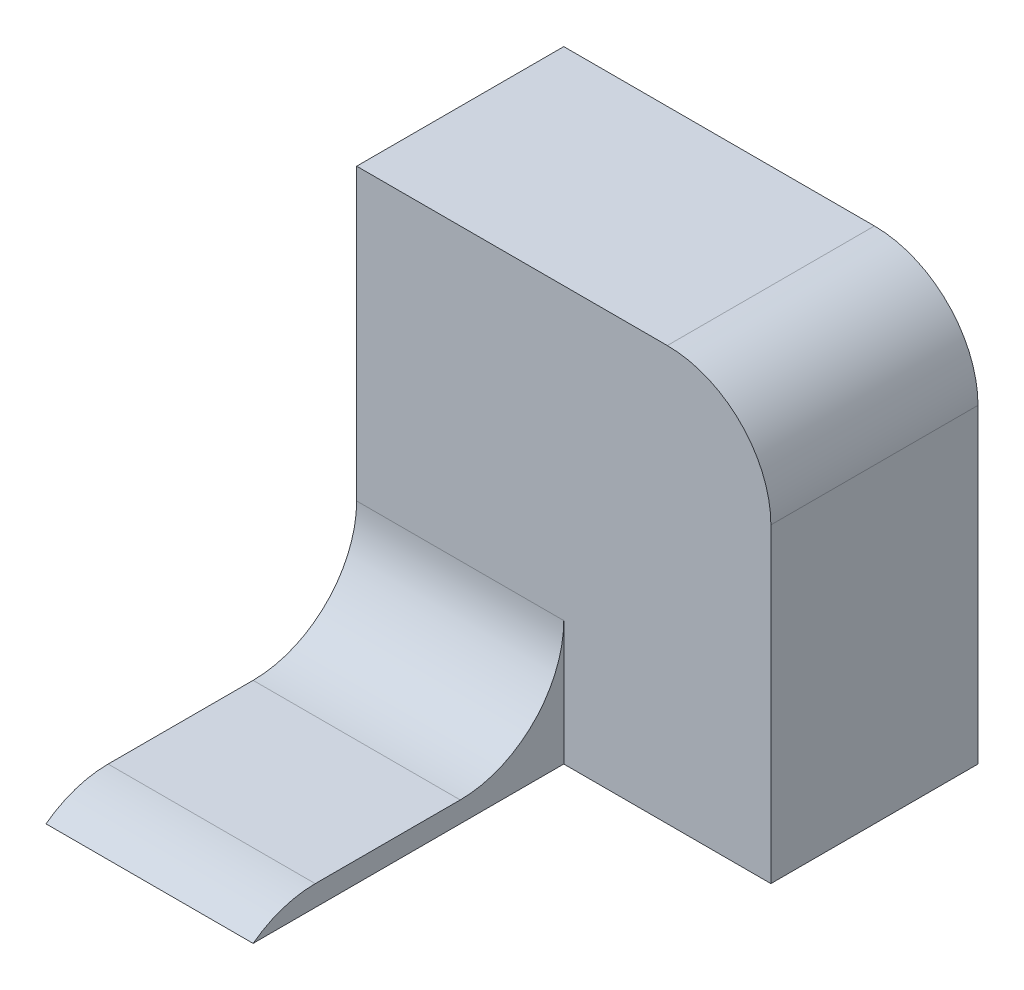
ISO-10303-21;
HEADER;
FILE_DESCRIPTION(('STEP AP214'),'2;1');
FILE_NAME('part.step','',(''),(''),'','','');
FILE_SCHEMA(('AUTOMOTIVE_DESIGN { 1 0 10303 214 1 1 1 1 }'));
ENDSEC;
DATA;
#1=APPLICATION_CONTEXT('core data for automotive mechanical design processes');
#2=APPLICATION_PROTOCOL_DEFINITION('international standard','automotive_design',2000,#1);
#3=PRODUCT_CONTEXT('',#1,'mechanical');
#4=PRODUCT('Part','Part','',(#3));
#5=PRODUCT_RELATED_PRODUCT_CATEGORY('part','',(#4));
#6=PRODUCT_DEFINITION_FORMATION('','',#4);
#7=PRODUCT_DEFINITION_CONTEXT('part definition',#1,'design');
#8=PRODUCT_DEFINITION('design','',#6,#7);
#9=PRODUCT_DEFINITION_SHAPE('','',#8);
#10=(LENGTH_UNIT() NAMED_UNIT(*) SI_UNIT(.MILLI.,.METRE.));
#11=(NAMED_UNIT(*) PLANE_ANGLE_UNIT() SI_UNIT($,.RADIAN.));
#12=(NAMED_UNIT(*) SI_UNIT($,.STERADIAN.) SOLID_ANGLE_UNIT());
#13=UNCERTAINTY_MEASURE_WITH_UNIT(LENGTH_MEASURE(1.E-05),#10,'distance_accuracy_value','');
#14=(GEOMETRIC_REPRESENTATION_CONTEXT(3) GLOBAL_UNCERTAINTY_ASSIGNED_CONTEXT((#13)) GLOBAL_UNIT_ASSIGNED_CONTEXT((#10,
#11,#12)) REPRESENTATION_CONTEXT('',''));
#15=CARTESIAN_POINT('',(0.,0.,0.));
#16=DIRECTION('',(0.,0.,1.));
#17=DIRECTION('',(1.,0.,0.));
#18=AXIS2_PLACEMENT_3D('',#15,#16,#17);
#19=CARTESIAN_POINT('',(-10.,0.,30.));
#20=DIRECTION('',(0.,-1.,0.));
#21=DIRECTION('',(1.,0.,0.));
#22=AXIS2_PLACEMENT_3D('',#19,#20,#21);
#23=PLANE('',#22);
#24=DIRECTION('',(0.,0.,-1.));
#25=VECTOR('',#24,1.);
#26=CARTESIAN_POINT('',(-10.,0.,30.));
#27=LINE('',#26,#25);
#28=CARTESIAN_POINT('',(-10.,0.,24.));
#29=VERTEX_POINT('',#28);
#30=CARTESIAN_POINT('',(-10.,0.,10.));
#31=VERTEX_POINT('',#30);
#32=EDGE_CURVE('E144',#29,#31,#27,.T.);
#33=ORIENTED_EDGE('',*,*,#32,.T.);
#34=DIRECTION('',(-1.,0.,0.));
#35=VECTOR('',#34,1.);
#36=CARTESIAN_POINT('',(-10.,0.,10.));
#37=LINE('',#36,#35);
#38=CARTESIAN_POINT('',(-30.,0.,10.));
#39=VERTEX_POINT('',#38);
#40=EDGE_CURVE('E158',#31,#39,#37,.T.);
#41=ORIENTED_EDGE('',*,*,#40,.T.);
#42=DIRECTION('',(0.,0.,-1.));
#43=VECTOR('',#42,1.);
#44=CARTESIAN_POINT('',(-30.,0.,30.));
#45=LINE('',#44,#43);
#46=CARTESIAN_POINT('',(-30.,0.,24.));
#47=VERTEX_POINT('',#46);
#48=EDGE_CURVE('E153',#47,#39,#45,.T.);
#49=ORIENTED_EDGE('',*,*,#48,.F.);
#50=DIRECTION('',(-1.,0.,0.));
#51=VECTOR('',#50,1.);
#52=CARTESIAN_POINT('',(-10.,0.,24.));
#53=LINE('',#52,#51);
#54=EDGE_CURVE('E156',#47,#29,#53,.F.);
#55=ORIENTED_EDGE('',*,*,#54,.T.);
#56=EDGE_LOOP('',(#33,#41,#49,#55));
#57=FACE_BOUND('',#56,.T.);
#58=ADVANCED_FACE('F35',(#57),#23,.F.);
#59=CARTESIAN_POINT('',(-30.,0.,30.));
#60=DIRECTION('',(1.,0.,0.));
#61=DIRECTION('',(0.,0.,-1.));
#62=AXIS2_PLACEMENT_3D('',#59,#60,#61);
#63=PLANE('',#62);
#64=DIRECTION('',(0.,0.,-1.));
#65=VECTOR('',#64,1.);
#66=CARTESIAN_POINT('',(-30.,-2.,30.));
#67=LINE('',#66,#65);
#68=CARTESIAN_POINT('',(-30.,-2.,30.));
#69=VERTEX_POINT('',#68);
#70=CARTESIAN_POINT('',(-30.,-2.,-20.));
#71=VERTEX_POINT('',#70);
#72=EDGE_CURVE('E151',#69,#71,#67,.T.);
#73=ORIENTED_EDGE('',*,*,#72,.F.);
#74=CARTESIAN_POINT('',(-30.,-10.,24.));
#75=DIRECTION('',(1.,0.,0.));
#76=DIRECTION('',(0.,0.,-1.));
#77=AXIS2_PLACEMENT_3D('',#74,#75,#76);
#78=CIRCLE('',#77,10.);
#79=EDGE_CURVE('E171',#69,#47,#78,.F.);
#80=ORIENTED_EDGE('',*,*,#79,.T.);
#81=ORIENTED_EDGE('',*,*,#48,.T.);
#82=CARTESIAN_POINT('',(-30.,10.,10.));
#83=DIRECTION('',(1.,0.,0.));
#84=DIRECTION('',(0.,0.,-1.));
#85=AXIS2_PLACEMENT_3D('',#82,#83,#84);
#86=CIRCLE('',#85,10.);
#87=CARTESIAN_POINT('',(-30.,10.,0.));
#88=VERTEX_POINT('',#87);
#89=EDGE_CURVE('E43',#39,#88,#86,.T.);
#90=ORIENTED_EDGE('',*,*,#89,.T.);
#91=DIRECTION('',(0.,-1.,0.));
#92=VECTOR('',#91,1.);
#93=CARTESIAN_POINT('',(-30.,38.,0.));
#94=LINE('',#93,#92);
#95=CARTESIAN_POINT('',(-30.,38.,0.));
#96=VERTEX_POINT('',#95);
#97=EDGE_CURVE('E119',#96,#88,#94,.T.);
#98=ORIENTED_EDGE('',*,*,#97,.F.);
#99=DIRECTION('',(0.,0.,1.));
#100=VECTOR('',#99,1.);
#101=CARTESIAN_POINT('',(-30.,38.,-20.));
#102=LINE('',#101,#100);
#103=CARTESIAN_POINT('',(-30.,38.,-20.));
#104=VERTEX_POINT('',#103);
#105=EDGE_CURVE('E108',#104,#96,#102,.T.);
#106=ORIENTED_EDGE('',*,*,#105,.F.);
#107=DIRECTION('',(0.,-1.,0.));
#108=VECTOR('',#107,1.);
#109=CARTESIAN_POINT('',(-30.,38.,-20.));
#110=LINE('',#109,#108);
#111=EDGE_CURVE('E111',#104,#71,#110,.T.);
#112=ORIENTED_EDGE('',*,*,#111,.T.);
#113=EDGE_LOOP('',(#73,#80,#81,#90,#98,#106,#112));
#114=FACE_BOUND('',#113,.T.);
#115=ADVANCED_FACE('F117',(#114),#63,.F.);
#116=CARTESIAN_POINT('',(-30.,-2.,30.));
#117=DIRECTION('',(0.,1.,0.));
#118=DIRECTION('',(0.,0.,1.));
#119=AXIS2_PLACEMENT_3D('',#116,#117,#118);
#120=PLANE('',#119);
#121=ORIENTED_EDGE('',*,*,#72,.T.);
#122=DIRECTION('',(1.,0.,0.));
#123=VECTOR('',#122,1.);
#124=CARTESIAN_POINT('',(-30.,-2.,-20.));
#125=LINE('',#124,#123);
#126=CARTESIAN_POINT('',(10.,-2.,-20.));
#127=VERTEX_POINT('',#126);
#128=EDGE_CURVE('E126',#71,#127,#125,.T.);
#129=ORIENTED_EDGE('',*,*,#128,.T.);
#130=DIRECTION('',(0.,0.,1.));
#131=VECTOR('',#130,1.);
#132=CARTESIAN_POINT('',(10.,-2.,-20.));
#133=LINE('',#132,#131);
#134=CARTESIAN_POINT('',(10.,-2.,0.));
#135=VERTEX_POINT('',#134);
#136=EDGE_CURVE('E120',#127,#135,#133,.T.);
#137=ORIENTED_EDGE('',*,*,#136,.T.);
#138=DIRECTION('',(1.,0.,0.));
#139=VECTOR('',#138,1.);
#140=CARTESIAN_POINT('',(-30.,-2.,0.));
#141=LINE('',#140,#139);
#142=CARTESIAN_POINT('',(-10.,-2.,0.));
#143=VERTEX_POINT('',#142);
#144=EDGE_CURVE('E134',#143,#135,#141,.T.);
#145=ORIENTED_EDGE('',*,*,#144,.F.);
#146=DIRECTION('',(0.,0.,-1.));
#147=VECTOR('',#146,1.);
#148=CARTESIAN_POINT('',(-10.,-2.,30.));
#149=LINE('',#148,#147);
#150=CARTESIAN_POINT('',(-10.,-2.,30.));
#151=VERTEX_POINT('',#150);
#152=EDGE_CURVE('E148',#151,#143,#149,.T.);
#153=ORIENTED_EDGE('',*,*,#152,.F.);
#154=DIRECTION('',(1.,0.,0.));
#155=VECTOR('',#154,1.);
#156=CARTESIAN_POINT('',(-30.,-2.,30.));
#157=LINE('',#156,#155);
#158=EDGE_CURVE('E141',#69,#151,#157,.T.);
#159=ORIENTED_EDGE('',*,*,#158,.F.);
#160=EDGE_LOOP('',(#121,#129,#137,#145,#153,#159));
#161=FACE_BOUND('',#160,.T.);
#162=ADVANCED_FACE('F193',(#161),#120,.F.);
#163=CARTESIAN_POINT('',(-10.,-2.,30.));
#164=DIRECTION('',(-1.,0.,0.));
#165=DIRECTION('',(0.,0.,1.));
#166=AXIS2_PLACEMENT_3D('',#163,#164,#165);
#167=PLANE('',#166);
#168=ORIENTED_EDGE('',*,*,#32,.F.);
#169=CARTESIAN_POINT('',(-10.,-10.,24.));
#170=DIRECTION('',(-1.,0.,0.));
#171=DIRECTION('',(0.,0.,1.));
#172=AXIS2_PLACEMENT_3D('',#169,#170,#171);
#173=CIRCLE('',#172,10.);
#174=EDGE_CURVE('E173',#29,#151,#173,.F.);
#175=ORIENTED_EDGE('',*,*,#174,.T.);
#176=ORIENTED_EDGE('',*,*,#152,.T.);
#177=DIRECTION('',(0.,1.,0.));
#178=VECTOR('',#177,1.);
#179=CARTESIAN_POINT('',(-10.,-2.,0.));
#180=LINE('',#179,#178);
#181=CARTESIAN_POINT('',(-10.,10.,0.));
#182=VERTEX_POINT('',#181);
#183=EDGE_CURVE('E139',#143,#182,#180,.T.);
#184=ORIENTED_EDGE('',*,*,#183,.T.);
#185=CARTESIAN_POINT('',(-10.,10.,10.));
#186=DIRECTION('',(-1.,0.,0.));
#187=DIRECTION('',(0.,0.,1.));
#188=AXIS2_PLACEMENT_3D('',#185,#186,#187);
#189=CIRCLE('',#188,10.);
#190=EDGE_CURVE('E11',#182,#31,#189,.T.);
#191=ORIENTED_EDGE('',*,*,#190,.T.);
#192=EDGE_LOOP('',(#168,#175,#176,#184,#191));
#193=FACE_BOUND('',#192,.T.);
#194=ADVANCED_FACE('F184',(#193),#167,.F.);
#195=CARTESIAN_POINT('',(0.,0.,0.));
#196=DIRECTION('',(0.,0.,1.));
#197=DIRECTION('',(1.,0.,0.));
#198=AXIS2_PLACEMENT_3D('',#195,#196,#197);
#199=PLANE('',#198);
#200=ORIENTED_EDGE('',*,*,#97,.T.);
#201=DIRECTION('',(-1.,0.,0.));
#202=VECTOR('',#201,1.);
#203=CARTESIAN_POINT('',(0.,10.,0.));
#204=LINE('',#203,#202);
#205=EDGE_CURVE('E163',#88,#182,#204,.F.);
#206=ORIENTED_EDGE('',*,*,#205,.T.);
#207=ORIENTED_EDGE('',*,*,#183,.F.);
#208=ORIENTED_EDGE('',*,*,#144,.T.);
#209=DIRECTION('',(0.,1.,0.));
#210=VECTOR('',#209,1.);
#211=CARTESIAN_POINT('',(10.,-2.,0.));
#212=LINE('',#211,#210);
#213=CARTESIAN_POINT('',(10.,28.,0.));
#214=VERTEX_POINT('',#213);
#215=EDGE_CURVE('E112',#135,#214,#212,.T.);
#216=ORIENTED_EDGE('',*,*,#215,.T.);
#217=CARTESIAN_POINT('',(0.,28.,0.));
#218=DIRECTION('',(0.,0.,1.));
#219=DIRECTION('',(1.,0.,0.));
#220=AXIS2_PLACEMENT_3D('',#217,#218,#219);
#221=CIRCLE('',#220,10.);
#222=CARTESIAN_POINT('',(0.,38.,0.));
#223=VERTEX_POINT('',#222);
#224=EDGE_CURVE('E161',#214,#223,#221,.T.);
#225=ORIENTED_EDGE('',*,*,#224,.T.);
#226=DIRECTION('',(-1.,0.,0.));
#227=VECTOR('',#226,1.);
#228=CARTESIAN_POINT('',(10.,38.,0.));
#229=LINE('',#228,#227);
#230=EDGE_CURVE('E131',#223,#96,#229,.T.);
#231=ORIENTED_EDGE('',*,*,#230,.T.);
#232=EDGE_LOOP('',(#200,#206,#207,#208,#216,#225,#231));
#233=FACE_BOUND('',#232,.T.);
#234=ADVANCED_FACE('F179',(#233),#199,.T.);
#235=CARTESIAN_POINT('',(10.,38.,-20.));
#236=DIRECTION('',(0.,1.,0.));
#237=DIRECTION('',(-1.,0.,0.));
#238=AXIS2_PLACEMENT_3D('',#235,#236,#237);
#239=PLANE('',#238);
#240=ORIENTED_EDGE('',*,*,#230,.F.);
#241=DIRECTION('',(0.,0.,1.));
#242=VECTOR('',#241,1.);
#243=CARTESIAN_POINT('',(0.,38.,-20.));
#244=LINE('',#243,#242);
#245=CARTESIAN_POINT('',(0.,38.,-20.));
#246=VERTEX_POINT('',#245);
#247=EDGE_CURVE('E50',#223,#246,#244,.F.);
#248=ORIENTED_EDGE('',*,*,#247,.T.);
#249=DIRECTION('',(-1.,0.,0.));
#250=VECTOR('',#249,1.);
#251=CARTESIAN_POINT('',(10.,38.,-20.));
#252=LINE('',#251,#250);
#253=EDGE_CURVE('E105',#246,#104,#252,.T.);
#254=ORIENTED_EDGE('',*,*,#253,.T.);
#255=ORIENTED_EDGE('',*,*,#105,.T.);
#256=EDGE_LOOP('',(#240,#248,#254,#255));
#257=FACE_BOUND('',#256,.T.);
#258=ADVANCED_FACE('F107',(#257),#239,.T.);
#259=CARTESIAN_POINT('',(10.,-2.,-20.));
#260=DIRECTION('',(1.,0.,0.));
#261=DIRECTION('',(0.,0.,-1.));
#262=AXIS2_PLACEMENT_3D('',#259,#260,#261);
#263=PLANE('',#262);
#264=DIRECTION('',(0.,1.,0.));
#265=VECTOR('',#264,1.);
#266=CARTESIAN_POINT('',(10.,-2.,-20.));
#267=LINE('',#266,#265);
#268=CARTESIAN_POINT('',(10.,28.,-20.));
#269=VERTEX_POINT('',#268);
#270=EDGE_CURVE('E121',#127,#269,#267,.T.);
#271=ORIENTED_EDGE('',*,*,#270,.T.);
#272=DIRECTION('',(0.,0.,1.));
#273=VECTOR('',#272,1.);
#274=CARTESIAN_POINT('',(10.,28.,-20.));
#275=LINE('',#274,#273);
#276=EDGE_CURVE('E166',#269,#214,#275,.T.);
#277=ORIENTED_EDGE('',*,*,#276,.T.);
#278=ORIENTED_EDGE('',*,*,#215,.F.);
#279=ORIENTED_EDGE('',*,*,#136,.F.);
#280=EDGE_LOOP('',(#271,#277,#278,#279));
#281=FACE_BOUND('',#280,.T.);
#282=ADVANCED_FACE('F196',(#281),#263,.T.);
#283=CARTESIAN_POINT('',(0.,0.,-20.));
#284=DIRECTION('',(0.,0.,1.));
#285=DIRECTION('',(1.,0.,0.));
#286=AXIS2_PLACEMENT_3D('',#283,#284,#285);
#287=PLANE('',#286);
#288=ORIENTED_EDGE('',*,*,#253,.F.);
#289=CARTESIAN_POINT('',(0.,28.,-20.));
#290=DIRECTION('',(0.,0.,1.));
#291=DIRECTION('',(1.,0.,0.));
#292=AXIS2_PLACEMENT_3D('',#289,#290,#291);
#293=CIRCLE('',#292,10.);
#294=EDGE_CURVE('E57',#246,#269,#293,.F.);
#295=ORIENTED_EDGE('',*,*,#294,.T.);
#296=ORIENTED_EDGE('',*,*,#270,.F.);
#297=ORIENTED_EDGE('',*,*,#128,.F.);
#298=ORIENTED_EDGE('',*,*,#111,.F.);
#299=EDGE_LOOP('',(#288,#295,#296,#297,#298));
#300=FACE_BOUND('',#299,.T.);
#301=ADVANCED_FACE('F124',(#300),#287,.F.);
#302=CARTESIAN_POINT('',(-10.,10.,10.));
#303=DIRECTION('',(-1.,0.,0.));
#304=DIRECTION('',(0.,-1.,0.));
#305=AXIS2_PLACEMENT_3D('',#302,#303,#304);
#306=CYLINDRICAL_SURFACE('',#305,10.);
#307=ORIENTED_EDGE('',*,*,#190,.F.);
#308=ORIENTED_EDGE('',*,*,#205,.F.);
#309=ORIENTED_EDGE('',*,*,#89,.F.);
#310=ORIENTED_EDGE('',*,*,#40,.F.);
#311=EDGE_LOOP('',(#307,#308,#309,#310));
#312=FACE_BOUND('',#311,.T.);
#313=ADVANCED_FACE('F181',(#312),#306,.F.);
#314=CARTESIAN_POINT('',(0.,28.,-20.));
#315=DIRECTION('',(0.,0.,1.));
#316=DIRECTION('',(1.,0.,0.));
#317=AXIS2_PLACEMENT_3D('',#314,#315,#316);
#318=CYLINDRICAL_SURFACE('',#317,10.);
#319=ORIENTED_EDGE('',*,*,#294,.F.);
#320=ORIENTED_EDGE('',*,*,#247,.F.);
#321=ORIENTED_EDGE('',*,*,#224,.F.);
#322=ORIENTED_EDGE('',*,*,#276,.F.);
#323=EDGE_LOOP('',(#319,#320,#321,#322));
#324=FACE_BOUND('',#323,.T.);
#325=ADVANCED_FACE('F199',(#324),#318,.T.);
#326=CARTESIAN_POINT('',(0.,-10.,24.));
#327=DIRECTION('',(-1.,0.,0.));
#328=DIRECTION('',(0.,0.,1.));
#329=AXIS2_PLACEMENT_3D('',#326,#327,#328);
#330=CYLINDRICAL_SURFACE('',#329,10.);
#331=ORIENTED_EDGE('',*,*,#174,.F.);
#332=ORIENTED_EDGE('',*,*,#54,.F.);
#333=ORIENTED_EDGE('',*,*,#79,.F.);
#334=ORIENTED_EDGE('',*,*,#158,.T.);
#335=EDGE_LOOP('',(#331,#332,#333,#334));
#336=FACE_BOUND('',#335,.T.);
#337=ADVANCED_FACE('F37',(#336),#330,.T.);
#338=CLOSED_SHELL('',(#58,#115,#162,#194,#234,#258,#282,#301,#313,#325,#337));
#339=MANIFOLD_SOLID_BREP('B2',#338);
#340=ADVANCED_BREP_SHAPE_REPRESENTATION('',(#18,#339),#14);
#341=SHAPE_DEFINITION_REPRESENTATION(#9,#340);
ENDSEC;
END-ISO-10303-21;
